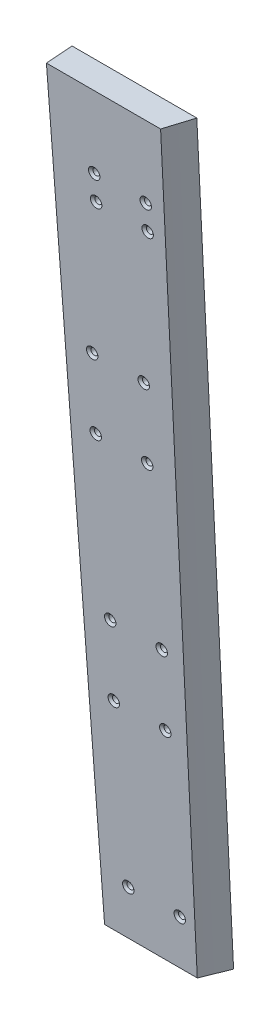
ISO-10303-21;
HEADER;
FILE_DESCRIPTION(('STEP AP214'),'2;1');
FILE_NAME('part.step','',(''),(''),'','','');
FILE_SCHEMA(('AUTOMOTIVE_DESIGN { 1 0 10303 214 1 1 1 1 }'));
ENDSEC;
DATA;
#1=APPLICATION_CONTEXT('core data for automotive mechanical design processes');
#2=APPLICATION_PROTOCOL_DEFINITION('international standard','automotive_design',2000,#1);
#3=PRODUCT_CONTEXT('',#1,'mechanical');
#4=PRODUCT('Part','Part','',(#3));
#5=PRODUCT_RELATED_PRODUCT_CATEGORY('part','',(#4));
#6=PRODUCT_DEFINITION_FORMATION('','',#4);
#7=PRODUCT_DEFINITION_CONTEXT('part definition',#1,'design');
#8=PRODUCT_DEFINITION('design','',#6,#7);
#9=PRODUCT_DEFINITION_SHAPE('','',#8);
#10=(LENGTH_UNIT() NAMED_UNIT(*) SI_UNIT(.MILLI.,.METRE.));
#11=(NAMED_UNIT(*) PLANE_ANGLE_UNIT() SI_UNIT($,.RADIAN.));
#12=(NAMED_UNIT(*) SI_UNIT($,.STERADIAN.) SOLID_ANGLE_UNIT());
#13=UNCERTAINTY_MEASURE_WITH_UNIT(LENGTH_MEASURE(1.E-05),#10,'distance_accuracy_value','');
#14=(GEOMETRIC_REPRESENTATION_CONTEXT(3) GLOBAL_UNCERTAINTY_ASSIGNED_CONTEXT((#13)) GLOBAL_UNIT_ASSIGNED_CONTEXT((#10,
#11,#12)) REPRESENTATION_CONTEXT('',''));
#15=CARTESIAN_POINT('',(0.,0.,0.));
#16=DIRECTION('',(0.,0.,1.));
#17=DIRECTION('',(1.,0.,0.));
#18=AXIS2_PLACEMENT_3D('',#15,#16,#17);
#19=CARTESIAN_POINT('',(312.419999999995,5767.77608949547,3278.73923989058));
#20=DIRECTION('',(0.,-0.0748289111295098,0.997196386906397));
#21=DIRECTION('',(0.,-0.997196386906397,-0.0748289111295096));
#22=AXIS2_PLACEMENT_3D('',#19,#20,#21);
#23=PLANE('',#22);
#24=CARTESIAN_POINT('',(343.482500000001,5710.44401659627,3274.43708171574));
#25=DIRECTION('',(0.,-0.0748289111295097,0.997196386906397));
#26=DIRECTION('',(0.,-0.997196386906397,-0.0748289111295096));
#27=AXIS2_PLACEMENT_3D('',#24,#25,#26);
#28=CIRCLE('',#27,4.21640000000001);
#29=CARTESIAN_POINT('',(343.482500000001,5706.23943775052,3274.12157309486));
#30=VERTEX_POINT('',#29);
#31=EDGE_CURVE('E299',#30,#30,#28,.T.);
#32=ORIENTED_EDGE('',*,*,#31,.F.);
#33=EDGE_LOOP('',(#32));
#34=FACE_BOUND('',#33,.T.);
#35=CARTESIAN_POINT('',(381.5825,5710.44401659627,3274.43708171574));
#36=DIRECTION('',(0.,-0.0748289111295097,0.997196386906397));
#37=DIRECTION('',(0.,-0.997196386906397,-0.0748289111295096));
#38=AXIS2_PLACEMENT_3D('',#35,#36,#37);
#39=CIRCLE('',#38,4.21640000000001);
#40=CARTESIAN_POINT('',(381.5825,5706.23943775052,3274.12157309486));
#41=VERTEX_POINT('',#40);
#42=EDGE_CURVE('E293',#41,#41,#39,.T.);
#43=ORIENTED_EDGE('',*,*,#42,.F.);
#44=EDGE_LOOP('',(#43));
#45=FACE_BOUND('',#44,.T.);
#46=CARTESIAN_POINT('',(381.5825,5691.44742542571,3273.01159095873));
#47=DIRECTION('',(0.,-0.0748289111295097,0.997196386906397));
#48=DIRECTION('',(0.,-0.997196386906397,-0.0748289111295096));
#49=AXIS2_PLACEMENT_3D('',#46,#47,#48);
#50=CIRCLE('',#49,4.21640000000001);
#51=CARTESIAN_POINT('',(381.5825,5687.24284657995,3272.69608233784));
#52=VERTEX_POINT('',#51);
#53=EDGE_CURVE('E286',#52,#52,#50,.T.);
#54=ORIENTED_EDGE('',*,*,#53,.F.);
#55=EDGE_LOOP('',(#54));
#56=FACE_BOUND('',#55,.T.);
#57=CARTESIAN_POINT('',(343.4825,5691.44742542571,3273.01159095873));
#58=DIRECTION('',(0.,-0.0748289111295097,0.997196386906397));
#59=DIRECTION('',(0.,-0.997196386906397,-0.0748289111295096));
#60=AXIS2_PLACEMENT_3D('',#57,#58,#59);
#61=CIRCLE('',#60,4.21640000000001);
#62=CARTESIAN_POINT('',(343.4825,5687.24284657995,3272.69608233784));
#63=VERTEX_POINT('',#62);
#64=EDGE_CURVE('E279',#63,#63,#61,.T.);
#65=ORIENTED_EDGE('',*,*,#64,.F.);
#66=EDGE_LOOP('',(#65));
#67=FACE_BOUND('',#66,.T.);
#68=CARTESIAN_POINT('',(332.58553483878,5585.25466109771,3265.04296107916));
#69=DIRECTION('',(0.,-0.0748289111295097,0.997196386906397));
#70=DIRECTION('',(0.,-0.997196386906397,-0.0748289111295096));
#71=AXIS2_PLACEMENT_3D('',#68,#69,#70);
#72=CIRCLE('',#71,4.21640000000001);
#73=CARTESIAN_POINT('',(332.58553483878,5581.05008225195,3264.72745245827));
#74=VERTEX_POINT('',#73);
#75=EDGE_CURVE('E272',#74,#74,#72,.T.);
#76=ORIENTED_EDGE('',*,*,#75,.F.);
#77=EDGE_LOOP('',(#76));
#78=FACE_BOUND('',#77,.T.);
#79=CARTESIAN_POINT('',(370.699301502672,5585.25466111012,3265.04296108009));
#80=DIRECTION('',(0.,-0.0748289111295097,0.997196386906397));
#81=DIRECTION('',(0.,-0.997196386906397,-0.0748289111295096));
#82=AXIS2_PLACEMENT_3D('',#79,#80,#81);
#83=CIRCLE('',#82,4.21640000000001);
#84=CARTESIAN_POINT('',(370.699301502672,5581.05008226437,3264.7274524592));
#85=VERTEX_POINT('',#84);
#86=EDGE_CURVE('E265',#85,#85,#83,.T.);
#87=ORIENTED_EDGE('',*,*,#86,.F.);
#88=EDGE_LOOP('',(#87));
#89=FACE_BOUND('',#88,.T.);
#90=CARTESIAN_POINT('',(369.230750677282,5530.74435745182,3260.95254647205));
#91=DIRECTION('',(0.,-0.0748289111295097,0.997196386906397));
#92=DIRECTION('',(0.,-0.997196386906397,-0.0748289111295096));
#93=AXIS2_PLACEMENT_3D('',#90,#91,#92);
#94=CIRCLE('',#93,4.21640000000001);
#95=CARTESIAN_POINT('',(369.230750677282,5526.53977860607,3260.63703785116));
#96=VERTEX_POINT('',#95);
#97=EDGE_CURVE('E258',#96,#96,#94,.T.);
#98=ORIENTED_EDGE('',*,*,#97,.F.);
#99=EDGE_LOOP('',(#98));
#100=FACE_BOUND('',#99,.T.);
#101=CARTESIAN_POINT('',(331.116984014263,5530.74435747201,3260.95254647356));
#102=DIRECTION('',(0.,-0.0748289111295097,0.997196386906397));
#103=DIRECTION('',(0.,-0.997196386906397,-0.0748289111295096));
#104=AXIS2_PLACEMENT_3D('',#101,#102,#103);
#105=CIRCLE('',#104,4.21640000000001);
#106=CARTESIAN_POINT('',(331.116984014263,5526.53977862626,3260.63703785268));
#107=VERTEX_POINT('',#106);
#108=EDGE_CURVE('E251',#107,#107,#105,.T.);
#109=ORIENTED_EDGE('',*,*,#108,.F.);
#110=EDGE_LOOP('',(#109));
#111=FACE_BOUND('',#110,.T.);
#112=CARTESIAN_POINT('',(332.585534839496,5407.45466109737,3251.7009749132));
#113=DIRECTION('',(0.,-0.0748289111295097,0.997196386906397));
#114=DIRECTION('',(0.,-0.997196386906397,-0.0748289111295096));
#115=AXIS2_PLACEMENT_3D('',#112,#113,#114);
#116=CIRCLE('',#115,4.21640000000001);
#117=CARTESIAN_POINT('',(332.585534839496,5403.25008225162,3251.38546629231));
#118=VERTEX_POINT('',#117);
#119=EDGE_CURVE('E244',#118,#118,#116,.T.);
#120=ORIENTED_EDGE('',*,*,#119,.F.);
#121=EDGE_LOOP('',(#120));
#122=FACE_BOUND('',#121,.T.);
#123=CARTESIAN_POINT('',(370.699301503388,5407.45466110813,3251.70097491401));
#124=DIRECTION('',(0.,-0.0748289111295097,0.997196386906397));
#125=DIRECTION('',(0.,-0.997196386906397,-0.0748289111295096));
#126=AXIS2_PLACEMENT_3D('',#123,#124,#125);
#127=CIRCLE('',#126,4.21640000000001);
#128=CARTESIAN_POINT('',(370.699301503388,5403.25008226238,3251.38546629312));
#129=VERTEX_POINT('',#128);
#130=EDGE_CURVE('E237',#129,#129,#127,.T.);
#131=ORIENTED_EDGE('',*,*,#130,.F.);
#132=EDGE_LOOP('',(#131));
#133=FACE_BOUND('',#132,.T.);
#134=CARTESIAN_POINT('',(369.230853476843,5352.94435745354,3247.61056030624));
#135=DIRECTION('',(0.,-0.0748289111295097,0.997196386906397));
#136=DIRECTION('',(0.,-0.997196386906397,-0.0748289111295096));
#137=AXIS2_PLACEMENT_3D('',#134,#135,#136);
#138=CIRCLE('',#137,4.21640000000001);
#139=CARTESIAN_POINT('',(369.230853476843,5348.73977860778,3247.29505168535));
#140=VERTEX_POINT('',#139);
#141=EDGE_CURVE('E230',#140,#140,#138,.T.);
#142=ORIENTED_EDGE('',*,*,#141,.F.);
#143=EDGE_LOOP('',(#142));
#144=FACE_BOUND('',#143,.T.);
#145=CARTESIAN_POINT('',(331.117086813825,5352.94435747207,3247.61056030763));
#146=DIRECTION('',(0.,-0.0748289111295097,0.997196386906397));
#147=DIRECTION('',(0.,-0.997196386906397,-0.0748289111295096));
#148=AXIS2_PLACEMENT_3D('',#145,#146,#147);
#149=CIRCLE('',#148,4.21640000000001);
#150=CARTESIAN_POINT('',(331.117086813825,5348.73977862632,3247.29505168674));
#151=VERTEX_POINT('',#150);
#152=EDGE_CURVE('E223',#151,#151,#149,.T.);
#153=ORIENTED_EDGE('',*,*,#152,.F.);
#154=EDGE_LOOP('',(#153));
#155=FACE_BOUND('',#154,.T.);
#156=CARTESIAN_POINT('',(370.699301503413,5229.65466110813,3238.35898874807));
#157=DIRECTION('',(0.,-0.0748289111295097,0.997196386906397));
#158=DIRECTION('',(0.,-0.997196386906397,-0.0748289111295096));
#159=AXIS2_PLACEMENT_3D('',#156,#157,#158);
#160=CIRCLE('',#159,4.21640000000001);
#161=CARTESIAN_POINT('',(370.699301503413,5225.45008226237,3238.04348012718));
#162=VERTEX_POINT('',#161);
#163=EDGE_CURVE('E216',#162,#162,#160,.T.);
#164=ORIENTED_EDGE('',*,*,#163,.F.);
#165=EDGE_LOOP('',(#164));
#166=FACE_BOUND('',#165,.T.);
#167=CARTESIAN_POINT('',(332.585534839522,5229.65466109737,3238.35898874726));
#168=DIRECTION('',(0.,-0.0748289111295097,0.997196386906397));
#169=DIRECTION('',(0.,-0.997196386906397,-0.0748289111295096));
#170=AXIS2_PLACEMENT_3D('',#167,#168,#169);
#171=CIRCLE('',#170,4.21640000000001);
#172=CARTESIAN_POINT('',(332.585534839522,5225.45008225162,3238.04348012638));
#173=VERTEX_POINT('',#172);
#174=EDGE_CURVE('E205',#173,#173,#171,.T.);
#175=ORIENTED_EDGE('',*,*,#174,.F.);
#176=EDGE_LOOP('',(#175));
#177=FACE_BOUND('',#176,.T.);
#178=DIRECTION('',(0.,-0.997196386906396,-0.0748289111295135));
#179=VECTOR('',#178,1.);
#180=CARTESIAN_POINT('',(312.419999999995,5767.77608949547,3278.73923989058));
#181=LINE('',#180,#179);
#182=CARTESIAN_POINT('',(312.419999999995,5767.77608949546,3278.73923989058));
#183=VERTEX_POINT('',#182);
#184=CARTESIAN_POINT('',(312.419999999996,5194.3,3235.706));
#185=VERTEX_POINT('',#184);
#186=EDGE_CURVE('E166',#183,#185,#181,.T.);
#187=ORIENTED_EDGE('',*,*,#186,.T.);
#188=DIRECTION('',(1.,0.,0.));
#189=VECTOR('',#188,1.);
#190=CARTESIAN_POINT('',(312.419999999996,5194.3,3235.706));
#191=LINE('',#190,#189);
#192=CARTESIAN_POINT('',(380.999999999788,5194.3,3235.70600000048));
#193=VERTEX_POINT('',#192);
#194=EDGE_CURVE('E102',#193,#185,#191,.F.);
#195=ORIENTED_EDGE('',*,*,#194,.F.);
#196=DIRECTION('',(-0.0276324655190278,-0.996815607984742,-0.0748003377489091));
#197=VECTOR('',#196,1.);
#198=CARTESIAN_POINT('',(388.968512318236,5481.75670364397,3257.27654760127));
#199=LINE('',#198,#197);
#200=CARTESIAN_POINT('',(396.897181125412,5767.77608949542,3278.73923989111));
#201=VERTEX_POINT('',#200);
#202=EDGE_CURVE('E98',#201,#193,#199,.T.);
#203=ORIENTED_EDGE('',*,*,#202,.F.);
#204=DIRECTION('',(1.,0.,0.));
#205=VECTOR('',#204,1.);
#206=CARTESIAN_POINT('',(312.419999999995,5767.77608949546,3278.73923989058));
#207=LINE('',#206,#205);
#208=EDGE_CURVE('E113',#183,#201,#207,.T.);
#209=ORIENTED_EDGE('',*,*,#208,.F.);
#210=EDGE_LOOP('',(#187,#195,#203,#209));
#211=FACE_BOUND('',#210,.T.);
#212=ADVANCED_FACE('F50',(#34,#45,#56,#67,#78,#89,#100,#111,#122,#133,#144,#155,#166,#177,#211),
#23,.T.);
#213=CARTESIAN_POINT('',(405.196853838781,5769.20076169359,3258.48146242823));
#214=CARTESIAN_POINT('',(399.713953138321,5577.55929881066,3244.52122134532));
#215=CARTESIAN_POINT('',(394.231054672582,5385.91783579814,3230.56097424694));
#216=CARTESIAN_POINT('',(388.74815891467,5194.27637261328,3216.60071985852));
#217=CARTESIAN_POINT('',(402.536032037975,5769.20517503958,3265.26188551318));
#218=CARTESIAN_POINT('',(397.108078605894,5577.56498966864,3251.16176934718));
#219=CARTESIAN_POINT('',(391.680127390671,5385.92480418547,3237.06164916942));
#220=CARTESIAN_POINT('',(386.252177322128,5194.28461860905,3222.96152394867));
#221=CARTESIAN_POINT('',(399.782874856838,5769.20939052787,3272.05044170521));
#222=CARTESIAN_POINT('',(394.41177201546,5577.57042539221,3257.81028396343));
#223=CARTESIAN_POINT('',(389.040670658161,5385.93146018714,3243.5701242145));
#224=CARTESIAN_POINT('',(383.669569532895,5194.29249494666,3229.32996185289));
#225=CARTESIAN_POINT('',(396.937024636896,5769.21340728806,3278.84709520156));
#226=CARTESIAN_POINT('',(391.624683091122,5577.57560485867,3264.46673013469));
#227=CARTESIAN_POINT('',(386.312341545349,5385.93780242927,3250.08636506784));
#228=CARTESIAN_POINT('',(380.999999999577,5194.2999999999,3235.70600000099));
#229=B_SPLINE_SURFACE_WITH_KNOTS('',3,3,((#213,#214,#215,#216),(#217,#218,#219,#220),(#221,#222,
#223,#224),(#225,#226,#227,#228)),.UNSPECIFIED.,.F.,.F.,.F.,(4,4),(4,4),(-0.0263043909921353,
1.3801359465942E-12),(66.3393463865698,123.945907551582),.UNSPECIFIED.);
#230=CARTESIAN_POINT('',(396.897181125634,5767.77608949546,3278.73923989058));
#231=CARTESIAN_POINT('',(400.91830917951,5768.48911461939,3269.23721631951));
#232=CARTESIAN_POINT('',(404.700902723824,5769.20158025248,3259.74264872));
#233=B_SPLINE_CURVE_WITH_KNOTS('',2,(#230,#231,#232),.UNSPECIFIED.,.F.,.F.,(3,3),(0.,1.),.UNSPECIFIED.);
#234=CARTESIAN_POINT('',(404.700902445732,5769.20158025437,3259.74264872015));
#235=VERTEX_POINT('',#234);
#236=EDGE_CURVE('E144',#201,#235,#233,.T.);
#237=CARTESIAN_POINT('',(388.748834672877,5194.3,3216.60244158623));
#238=CARTESIAN_POINT('',(388.075829832683,5194.30000000001,3218.31721533994));
#239=CARTESIAN_POINT('',(387.397559503474,5194.30000000001,3220.02991977192));
#240=CARTESIAN_POINT('',(386.030596461004,5194.30000000001,3223.45116430792));
#241=CARTESIAN_POINT('',(385.341903748529,5194.30000000001,3225.15970441226));
#242=CARTESIAN_POINT('',(383.447384508373,5194.3,3229.81906148917));
#243=CARTESIAN_POINT('',(382.231272738763,5194.3,3232.76570034628));
#244=CARTESIAN_POINT('',(380.999999999791,5194.30000000001,3235.70600000049));
#245=B_SPLINE_CURVE_WITH_KNOTS('',3,(#237,#238,#239,#240,#241,#242,#243,#244),.UNSPECIFIED.,.F.,
.F.,(4,2,2,4),(0.,5.5263289650897,11.0526575132116,20.6156723645517),.UNSPECIFIED.);
#246=CARTESIAN_POINT('',(388.748833941195,5194.30000000001,3216.60244129906));
#247=VERTEX_POINT('',#246);
#248=EDGE_CURVE('E92',#247,#193,#245,.T.);
#249=CARTESIAN_POINT('',(404.700902167638,5769.20158025625,3259.7426487203));
#250=CARTESIAN_POINT('',(404.293319696534,5754.51171006712,3258.64033125774));
#251=CARTESIAN_POINT('',(403.885735478663,5739.82183992617,3257.5380137988));
#252=CARTESIAN_POINT('',(401.847805523786,5666.37248946604,3252.02642652244));
#253=CARTESIAN_POINT('',(400.217433190222,5607.61300988068,3247.61715676009));
#254=CARTESIAN_POINT('',(396.947394798616,5489.76127418242,3238.77364592029));
#255=CARTESIAN_POINT('',(395.307728399182,5430.66901807896,3234.33940484353));
#256=CARTESIAN_POINT('',(392.028331025051,5312.48450765377,3225.47092282373));
#257=CARTESIAN_POINT('',(390.388600050355,5253.39225333205,3221.03668188068));
#258=CARTESIAN_POINT('',(388.748834896997,5194.29999995344,3216.6024410084));
#259=B_SPLINE_CURVE_WITH_KNOTS('',3,(#249,#250,#251,#252,#253,#254,#255,#256,#257,#258),
.UNSPECIFIED.,.F.,.F.,(4,2,2,2,4),(0.,44.210424346468,221.052121732371,398.89534364712,
576.738565562073),.UNSPECIFIED.);
#260=EDGE_CURVE('E96',#235,#247,#259,.T.);
#261=ORIENTED_EDGE('',*,*,#236,.F.);
#262=ORIENTED_EDGE('',*,*,#202,.T.);
#263=ORIENTED_EDGE('',*,*,#248,.F.);
#264=ORIENTED_EDGE('',*,*,#260,.F.);
#265=EDGE_LOOP('',(#261,#262,#263,#264));
#266=FACE_BOUND('',#265,.T.);
#267=ADVANCED_FACE('F52',(#266),#229,.T.);
#268=CARTESIAN_POINT('',(312.419999999996,5194.3,3235.706));
#269=DIRECTION('',(0.,-1.,0.));
#270=DIRECTION('',(0.,0.,-1.));
#271=AXIS2_PLACEMENT_3D('',#268,#269,#270);
#272=PLANE('',#271);
#273=DIRECTION('',(0.,0.,-1.));
#274=VECTOR('',#273,1.);
#275=CARTESIAN_POINT('',(312.419999999996,5194.3,3247.67084045122));
#276=LINE('',#275,#274);
#277=CARTESIAN_POINT('',(312.419999999996,5194.3,3216.60244101189));
#278=VERTEX_POINT('',#277);
#279=EDGE_CURVE('E108',#185,#278,#276,.T.);
#280=ORIENTED_EDGE('',*,*,#279,.T.);
#281=DIRECTION('',(1.,0.,0.));
#282=VECTOR('',#281,1.);
#283=CARTESIAN_POINT('',(312.419999999996,5194.3,3216.60244101189));
#284=LINE('',#283,#282);
#285=EDGE_CURVE('E105',#247,#278,#284,.F.);
#286=ORIENTED_EDGE('',*,*,#285,.F.);
#287=ORIENTED_EDGE('',*,*,#248,.T.);
#288=ORIENTED_EDGE('',*,*,#194,.T.);
#289=EDGE_LOOP('',(#280,#286,#287,#288));
#290=FACE_BOUND('',#289,.T.);
#291=ADVANCED_FACE('F106',(#290),#272,.T.);
#292=CARTESIAN_POINT('',(312.419999999995,5481.75079012623,3247.67084045122));
#293=DIRECTION('',(1.,0.,0.));
#294=DIRECTION('',(0.,0.,-1.));
#295=AXIS2_PLACEMENT_3D('',#292,#293,#294);
#296=PLANE('',#295);
#297=ORIENTED_EDGE('',*,*,#279,.F.);
#298=ORIENTED_EDGE('',*,*,#186,.F.);
#299=DIRECTION('',(0.,-0.0748289111295177,0.997196386906396));
#300=VECTOR('',#299,1.);
#301=CARTESIAN_POINT('',(312.419999999994,5769.20158025248,3259.74264872));
#302=LINE('',#301,#300);
#303=CARTESIAN_POINT('',(312.419999999995,5769.20158025248,3259.74264872001));
#304=VERTEX_POINT('',#303);
#305=EDGE_CURVE('E72',#304,#183,#302,.T.);
#306=ORIENTED_EDGE('',*,*,#305,.F.);
#307=DIRECTION('',(0.,0.997196386906397,0.0748289111295111));
#308=VECTOR('',#307,1.);
#309=CARTESIAN_POINT('',(312.419999999996,5194.3,3216.60244101189));
#310=LINE('',#309,#308);
#311=EDGE_CURVE('E63',#278,#304,#310,.T.);
#312=ORIENTED_EDGE('',*,*,#311,.F.);
#313=EDGE_LOOP('',(#297,#298,#306,#312));
#314=FACE_BOUND('',#313,.T.);
#315=ADVANCED_FACE('F141',(#314),#296,.F.);
#316=CARTESIAN_POINT('',(312.419999999994,5769.20158025248,3259.74264872));
#317=DIRECTION('',(0.,0.997196386906397,0.0748289111295177));
#318=DIRECTION('',(0.,-0.0748289111295177,0.997196386906396));
#319=AXIS2_PLACEMENT_3D('',#316,#317,#318);
#320=PLANE('',#319);
#321=ORIENTED_EDGE('',*,*,#305,.T.);
#322=ORIENTED_EDGE('',*,*,#208,.T.);
#323=ORIENTED_EDGE('',*,*,#236,.T.);
#324=DIRECTION('',(1.,0.,0.));
#325=VECTOR('',#324,1.);
#326=CARTESIAN_POINT('',(312.419999999995,5769.20158025248,3259.74264872001));
#327=LINE('',#326,#325);
#328=EDGE_CURVE('E13',#304,#235,#327,.T.);
#329=ORIENTED_EDGE('',*,*,#328,.F.);
#330=EDGE_LOOP('',(#321,#322,#323,#329));
#331=FACE_BOUND('',#330,.T.);
#332=ADVANCED_FACE('F135',(#331),#320,.T.);
#333=CARTESIAN_POINT('',(312.419999999996,5194.3,3216.60244101189));
#334=DIRECTION('',(0.,0.0748289111295113,-0.997196386906397));
#335=DIRECTION('',(0.,0.997196386906397,0.0748289111295111));
#336=AXIS2_PLACEMENT_3D('',#333,#334,#335);
#337=PLANE('',#336);
#338=CARTESIAN_POINT('',(343.4825,5711.86950735329,3255.44049054518));
#339=DIRECTION('',(0.,0.0748289111295113,-0.997196386906397));
#340=DIRECTION('',(0.,0.997196386906397,0.0748289111295111));
#341=AXIS2_PLACEMENT_3D('',#338,#339,#340);
#342=CIRCLE('',#341,2.45744999999997);
#343=CARTESIAN_POINT('',(343.4825,5714.32006761429,3255.62437885284));
#344=VERTEX_POINT('',#343);
#345=EDGE_CURVE('E57',#344,#344,#342,.T.);
#346=ORIENTED_EDGE('',*,*,#345,.F.);
#347=EDGE_LOOP('',(#346));
#348=FACE_BOUND('',#347,.T.);
#349=CARTESIAN_POINT('',(381.5825,5711.86950735329,3255.44049054518));
#350=DIRECTION('',(0.,0.0748289111295113,-0.997196386906397));
#351=DIRECTION('',(0.,0.997196386906397,0.0748289111295111));
#352=AXIS2_PLACEMENT_3D('',#349,#350,#351);
#353=CIRCLE('',#352,2.45744999999997);
#354=CARTESIAN_POINT('',(381.5825,5714.32006761429,3255.62437885284));
#355=VERTEX_POINT('',#354);
#356=EDGE_CURVE('E289',#355,#355,#353,.T.);
#357=ORIENTED_EDGE('',*,*,#356,.F.);
#358=EDGE_LOOP('',(#357));
#359=FACE_BOUND('',#358,.T.);
#360=CARTESIAN_POINT('',(381.582500000001,5692.87291618272,3254.01499978816));
#361=DIRECTION('',(0.,0.0748289111295113,-0.997196386906397));
#362=DIRECTION('',(0.,0.997196386906397,0.0748289111295111));
#363=AXIS2_PLACEMENT_3D('',#360,#361,#362);
#364=CIRCLE('',#363,2.45744999999997);
#365=CARTESIAN_POINT('',(381.582500000001,5695.32347644373,3254.19888809582));
#366=VERTEX_POINT('',#365);
#367=EDGE_CURVE('E282',#366,#366,#364,.T.);
#368=ORIENTED_EDGE('',*,*,#367,.F.);
#369=EDGE_LOOP('',(#368));
#370=FACE_BOUND('',#369,.T.);
#371=CARTESIAN_POINT('',(343.4825,5692.87291618272,3254.01499978816));
#372=DIRECTION('',(0.,0.0748289111295113,-0.997196386906397));
#373=DIRECTION('',(0.,0.997196386906397,0.0748289111295111));
#374=AXIS2_PLACEMENT_3D('',#371,#372,#373);
#375=CIRCLE('',#374,2.45744999999997);
#376=CARTESIAN_POINT('',(343.4825,5695.32347644373,3254.19888809582));
#377=VERTEX_POINT('',#376);
#378=EDGE_CURVE('E275',#377,#377,#375,.T.);
#379=ORIENTED_EDGE('',*,*,#378,.F.);
#380=EDGE_LOOP('',(#379));
#381=FACE_BOUND('',#380,.T.);
#382=CARTESIAN_POINT('',(332.585534838781,5586.68015185472,3246.0463699086));
#383=DIRECTION('',(0.,0.0748289111295113,-0.997196386906397));
#384=DIRECTION('',(0.,0.997196386906397,0.0748289111295111));
#385=AXIS2_PLACEMENT_3D('',#382,#383,#384);
#386=CIRCLE('',#385,2.45744999999997);
#387=CARTESIAN_POINT('',(332.585534838781,5589.13071211573,3246.23025821625));
#388=VERTEX_POINT('',#387);
#389=EDGE_CURVE('E268',#388,#388,#386,.T.);
#390=ORIENTED_EDGE('',*,*,#389,.F.);
#391=EDGE_LOOP('',(#390));
#392=FACE_BOUND('',#391,.T.);
#393=CARTESIAN_POINT('',(370.699301502672,5586.68015186714,3246.04636990953));
#394=DIRECTION('',(0.,0.0748289111295113,-0.997196386906397));
#395=DIRECTION('',(0.,0.997196386906397,0.0748289111295111));
#396=AXIS2_PLACEMENT_3D('',#393,#394,#395);
#397=CIRCLE('',#396,2.45744999999997);
#398=CARTESIAN_POINT('',(370.699301502672,5589.13071212814,3246.23025821719));
#399=VERTEX_POINT('',#398);
#400=EDGE_CURVE('E261',#399,#399,#397,.T.);
#401=ORIENTED_EDGE('',*,*,#400,.F.);
#402=EDGE_LOOP('',(#401));
#403=FACE_BOUND('',#402,.T.);
#404=CARTESIAN_POINT('',(369.230750677281,5532.16984820883,3241.95595530149));
#405=DIRECTION('',(0.,0.0748289111295113,-0.997196386906397));
#406=DIRECTION('',(0.,0.997196386906397,0.0748289111295111));
#407=AXIS2_PLACEMENT_3D('',#404,#405,#406);
#408=CIRCLE('',#407,2.45744999999997);
#409=CARTESIAN_POINT('',(369.230750677281,5534.62040846984,3242.13984360914));
#410=VERTEX_POINT('',#409);
#411=EDGE_CURVE('E254',#410,#410,#408,.T.);
#412=ORIENTED_EDGE('',*,*,#411,.F.);
#413=EDGE_LOOP('',(#412));
#414=FACE_BOUND('',#413,.T.);
#415=CARTESIAN_POINT('',(331.116984014264,5532.16984822903,3241.955955303));
#416=DIRECTION('',(0.,0.0748289111295113,-0.997196386906397));
#417=DIRECTION('',(0.,0.997196386906397,0.0748289111295111));
#418=AXIS2_PLACEMENT_3D('',#415,#416,#417);
#419=CIRCLE('',#418,2.45744999999997);
#420=CARTESIAN_POINT('',(331.116984014264,5534.62040849003,3242.13984361066));
#421=VERTEX_POINT('',#420);
#422=EDGE_CURVE('E247',#421,#421,#419,.T.);
#423=ORIENTED_EDGE('',*,*,#422,.F.);
#424=EDGE_LOOP('',(#423));
#425=FACE_BOUND('',#424,.T.);
#426=CARTESIAN_POINT('',(332.585534839497,5408.88015185439,3232.70438374264));
#427=DIRECTION('',(0.,0.0748289111295113,-0.997196386906397));
#428=DIRECTION('',(0.,0.997196386906397,0.0748289111295111));
#429=AXIS2_PLACEMENT_3D('',#426,#427,#428);
#430=CIRCLE('',#429,2.45744999999997);
#431=CARTESIAN_POINT('',(332.585534839497,5411.33071211539,3232.88827205029));
#432=VERTEX_POINT('',#431);
#433=EDGE_CURVE('E240',#432,#432,#430,.T.);
#434=ORIENTED_EDGE('',*,*,#433,.F.);
#435=EDGE_LOOP('',(#434));
#436=FACE_BOUND('',#435,.T.);
#437=CARTESIAN_POINT('',(370.699301503388,5408.88015186514,3232.70438374344));
#438=DIRECTION('',(0.,0.0748289111295113,-0.997196386906397));
#439=DIRECTION('',(0.,0.997196386906397,0.0748289111295111));
#440=AXIS2_PLACEMENT_3D('',#437,#438,#439);
#441=CIRCLE('',#440,2.45744999999997);
#442=CARTESIAN_POINT('',(370.699301503388,5411.33071212615,3232.8882720511));
#443=VERTEX_POINT('',#442);
#444=EDGE_CURVE('E233',#443,#443,#441,.T.);
#445=ORIENTED_EDGE('',*,*,#444,.F.);
#446=EDGE_LOOP('',(#445));
#447=FACE_BOUND('',#446,.T.);
#448=CARTESIAN_POINT('',(369.230853476842,5354.36984821055,3228.61396913568));
#449=DIRECTION('',(0.,0.0748289111295113,-0.997196386906397));
#450=DIRECTION('',(0.,0.997196386906397,0.0748289111295111));
#451=AXIS2_PLACEMENT_3D('',#448,#449,#450);
#452=CIRCLE('',#451,2.45744999999997);
#453=CARTESIAN_POINT('',(369.230853476842,5356.82040847156,3228.79785744333));
#454=VERTEX_POINT('',#453);
#455=EDGE_CURVE('E226',#454,#454,#452,.T.);
#456=ORIENTED_EDGE('',*,*,#455,.F.);
#457=EDGE_LOOP('',(#456));
#458=FACE_BOUND('',#457,.T.);
#459=CARTESIAN_POINT('',(331.117086813826,5354.36984822909,3228.61396913707));
#460=DIRECTION('',(0.,0.0748289111295113,-0.997196386906397));
#461=DIRECTION('',(0.,0.997196386906397,0.0748289111295111));
#462=AXIS2_PLACEMENT_3D('',#459,#460,#461);
#463=CIRCLE('',#462,2.45744999999997);
#464=CARTESIAN_POINT('',(331.117086813826,5356.82040849009,3228.79785744472));
#465=VERTEX_POINT('',#464);
#466=EDGE_CURVE('E219',#465,#465,#463,.T.);
#467=ORIENTED_EDGE('',*,*,#466,.F.);
#468=EDGE_LOOP('',(#467));
#469=FACE_BOUND('',#468,.T.);
#470=CARTESIAN_POINT('',(370.699301503413,5231.08015186514,3219.36239757751));
#471=DIRECTION('',(0.,0.0748289111295113,-0.997196386906397));
#472=DIRECTION('',(0.,0.997196386906397,0.0748289111295111));
#473=AXIS2_PLACEMENT_3D('',#470,#471,#472);
#474=CIRCLE('',#473,2.45744999999997);
#475=CARTESIAN_POINT('',(370.699301503413,5233.53071212615,3219.54628588516));
#476=VERTEX_POINT('',#475);
#477=EDGE_CURVE('E207',#476,#476,#474,.T.);
#478=ORIENTED_EDGE('',*,*,#477,.F.);
#479=EDGE_LOOP('',(#478));
#480=FACE_BOUND('',#479,.T.);
#481=CARTESIAN_POINT('',(332.585534839521,5231.08015185439,3219.3623975767));
#482=DIRECTION('',(0.,0.0748289111295113,-0.997196386906397));
#483=DIRECTION('',(0.,0.997196386906397,0.0748289111295111));
#484=AXIS2_PLACEMENT_3D('',#481,#482,#483);
#485=CIRCLE('',#484,2.45744999999997);
#486=CARTESIAN_POINT('',(332.585534839521,5233.53071211539,3219.54628588435));
#487=VERTEX_POINT('',#486);
#488=EDGE_CURVE('E202',#487,#487,#485,.T.);
#489=ORIENTED_EDGE('',*,*,#488,.F.);
#490=EDGE_LOOP('',(#489));
#491=FACE_BOUND('',#490,.T.);
#492=ORIENTED_EDGE('',*,*,#311,.T.);
#493=ORIENTED_EDGE('',*,*,#328,.T.);
#494=ORIENTED_EDGE('',*,*,#260,.T.);
#495=ORIENTED_EDGE('',*,*,#285,.T.);
#496=EDGE_LOOP('',(#492,#493,#494,#495));
#497=FACE_BOUND('',#496,.T.);
#498=ADVANCED_FACE('F112',(#348,#359,#370,#381,#392,#403,#414,#425,#436,#447,#458,#469,#480,
#491,#497),#337,.T.);
#499=CARTESIAN_POINT('',(332.585534839522,5229.65466109737,3238.35898874726));
#500=DIRECTION('',(0.,-0.0748289111295097,0.997196386906397));
#501=DIRECTION('',(0.,-0.997196386906397,-0.0748289111295096));
#502=AXIS2_PLACEMENT_3D('',#499,#500,#501);
#503=CYLINDRICAL_SURFACE('',#502,2.45744999999997);
#504=ORIENTED_EDGE('',*,*,#488,.T.);
#505=EDGE_LOOP('',(#504));
#506=FACE_BOUND('',#505,.T.);
#507=CARTESIAN_POINT('',(332.585534839523,5229.76510365366,3236.88719239972));
#508=DIRECTION('',(0.,-0.0748289111295097,0.997196386906397));
#509=DIRECTION('',(0.,-0.997196386906397,-0.0748289111295096));
#510=AXIS2_PLACEMENT_3D('',#507,#508,#509);
#511=CIRCLE('',#510,2.45744999999997);
#512=CARTESIAN_POINT('',(332.585534839523,5227.31454339266,3236.70330409207));
#513=VERTEX_POINT('',#512);
#514=EDGE_CURVE('E147',#513,#513,#511,.T.);
#515=ORIENTED_EDGE('',*,*,#514,.T.);
#516=EDGE_LOOP('',(#515));
#517=FACE_BOUND('',#516,.T.);
#518=ADVANCED_FACE('F134',(#506,#517),#503,.F.);
#519=CARTESIAN_POINT('',(332.585534839522,5229.65466109737,3238.35898874726));
#520=DIRECTION('',(0.,-0.0748289111295097,0.997196386906397));
#521=DIRECTION('',(0.,-0.997196386906397,-0.0748289111295096));
#522=AXIS2_PLACEMENT_3D('',#519,#520,#521);
#523=CONICAL_SURFACE('',#522,4.21640000000001,0.872664625997234);
#524=ORIENTED_EDGE('',*,*,#514,.F.);
#525=EDGE_LOOP('',(#524));
#526=FACE_BOUND('',#525,.T.);
#527=ORIENTED_EDGE('',*,*,#174,.T.);
#528=EDGE_LOOP('',(#527));
#529=FACE_BOUND('',#528,.T.);
#530=ADVANCED_FACE('F192',(#526,#529),#523,.F.);
#531=CARTESIAN_POINT('',(370.699301503413,5229.65466110813,3238.35898874807));
#532=DIRECTION('',(0.,-0.0748289111295097,0.997196386906397));
#533=DIRECTION('',(0.,-0.997196386906397,-0.0748289111295096));
#534=AXIS2_PLACEMENT_3D('',#531,#532,#533);
#535=CYLINDRICAL_SURFACE('',#534,2.45744999999997);
#536=ORIENTED_EDGE('',*,*,#477,.T.);
#537=EDGE_LOOP('',(#536));
#538=FACE_BOUND('',#537,.T.);
#539=CARTESIAN_POINT('',(370.699301503413,5229.76510366441,3236.88719240053));
#540=DIRECTION('',(0.,-0.0748289111295097,0.997196386906397));
#541=DIRECTION('',(0.,-0.997196386906397,-0.0748289111295096));
#542=AXIS2_PLACEMENT_3D('',#539,#540,#541);
#543=CIRCLE('',#542,2.45744999999997);
#544=CARTESIAN_POINT('',(370.699301503413,5227.31454340341,3236.70330409287));
#545=VERTEX_POINT('',#544);
#546=EDGE_CURVE('E211',#545,#545,#543,.T.);
#547=ORIENTED_EDGE('',*,*,#546,.T.);
#548=EDGE_LOOP('',(#547));
#549=FACE_BOUND('',#548,.T.);
#550=ADVANCED_FACE('F197',(#538,#549),#535,.F.);
#551=CARTESIAN_POINT('',(370.699301503413,5229.65466110813,3238.35898874807));
#552=DIRECTION('',(0.,-0.0748289111295097,0.997196386906397));
#553=DIRECTION('',(0.,-0.997196386906397,-0.0748289111295096));
#554=AXIS2_PLACEMENT_3D('',#551,#552,#553);
#555=CONICAL_SURFACE('',#554,4.21640000000001,0.872664625997234);
#556=ORIENTED_EDGE('',*,*,#546,.F.);
#557=EDGE_LOOP('',(#556));
#558=FACE_BOUND('',#557,.T.);
#559=ORIENTED_EDGE('',*,*,#163,.T.);
#560=EDGE_LOOP('',(#559));
#561=FACE_BOUND('',#560,.T.);
#562=ADVANCED_FACE('F401',(#558,#561),#555,.F.);
#563=CARTESIAN_POINT('',(331.117086813825,5352.94435747207,3247.61056030763));
#564=DIRECTION('',(0.,-0.0748289111295097,0.997196386906397));
#565=DIRECTION('',(0.,-0.997196386906397,-0.0748289111295096));
#566=AXIS2_PLACEMENT_3D('',#563,#564,#565);
#567=CYLINDRICAL_SURFACE('',#566,2.45744999999997);
#568=ORIENTED_EDGE('',*,*,#466,.T.);
#569=EDGE_LOOP('',(#568));
#570=FACE_BOUND('',#569,.T.);
#571=CARTESIAN_POINT('',(331.117086813826,5353.05480002836,3246.13876396009));
#572=DIRECTION('',(0.,-0.0748289111295097,0.997196386906397));
#573=DIRECTION('',(0.,-0.997196386906397,-0.0748289111295096));
#574=AXIS2_PLACEMENT_3D('',#571,#572,#573);
#575=CIRCLE('',#574,2.45744999999997);
#576=CARTESIAN_POINT('',(331.117086813826,5350.60423976735,3245.95487565244));
#577=VERTEX_POINT('',#576);
#578=EDGE_CURVE('E220',#577,#577,#575,.T.);
#579=ORIENTED_EDGE('',*,*,#578,.T.);
#580=EDGE_LOOP('',(#579));
#581=FACE_BOUND('',#580,.T.);
#582=ADVANCED_FACE('F397',(#570,#581),#567,.F.);
#583=CARTESIAN_POINT('',(331.117086813825,5352.94435747207,3247.61056030763));
#584=DIRECTION('',(0.,-0.0748289111295097,0.997196386906397));
#585=DIRECTION('',(0.,-0.997196386906397,-0.0748289111295096));
#586=AXIS2_PLACEMENT_3D('',#583,#584,#585);
#587=CONICAL_SURFACE('',#586,4.21640000000001,0.872664625997234);
#588=ORIENTED_EDGE('',*,*,#578,.F.);
#589=EDGE_LOOP('',(#588));
#590=FACE_BOUND('',#589,.T.);
#591=ORIENTED_EDGE('',*,*,#152,.T.);
#592=EDGE_LOOP('',(#591));
#593=FACE_BOUND('',#592,.T.);
#594=ADVANCED_FACE('F393',(#590,#593),#587,.F.);
#595=CARTESIAN_POINT('',(369.230853476843,5352.94435745354,3247.61056030624));
#596=DIRECTION('',(0.,-0.0748289111295097,0.997196386906397));
#597=DIRECTION('',(0.,-0.997196386906397,-0.0748289111295096));
#598=AXIS2_PLACEMENT_3D('',#595,#596,#597);
#599=CYLINDRICAL_SURFACE('',#598,2.45744999999997);
#600=ORIENTED_EDGE('',*,*,#455,.T.);
#601=EDGE_LOOP('',(#600));
#602=FACE_BOUND('',#601,.T.);
#603=CARTESIAN_POINT('',(369.230853476842,5353.05480000983,3246.1387639587));
#604=DIRECTION('',(0.,-0.0748289111295097,0.997196386906397));
#605=DIRECTION('',(0.,-0.997196386906397,-0.0748289111295096));
#606=AXIS2_PLACEMENT_3D('',#603,#604,#605);
#607=CIRCLE('',#606,2.45744999999997);
#608=CARTESIAN_POINT('',(369.230853476842,5350.60423974882,3245.95487565105));
#609=VERTEX_POINT('',#608);
#610=EDGE_CURVE('E227',#609,#609,#607,.T.);
#611=ORIENTED_EDGE('',*,*,#610,.T.);
#612=EDGE_LOOP('',(#611));
#613=FACE_BOUND('',#612,.T.);
#614=ADVANCED_FACE('F389',(#602,#613),#599,.F.);
#615=CARTESIAN_POINT('',(369.230853476843,5352.94435745354,3247.61056030624));
#616=DIRECTION('',(0.,-0.0748289111295097,0.997196386906397));
#617=DIRECTION('',(0.,-0.997196386906397,-0.0748289111295096));
#618=AXIS2_PLACEMENT_3D('',#615,#616,#617);
#619=CONICAL_SURFACE('',#618,4.21640000000001,0.872664625997234);
#620=ORIENTED_EDGE('',*,*,#610,.F.);
#621=EDGE_LOOP('',(#620));
#622=FACE_BOUND('',#621,.T.);
#623=ORIENTED_EDGE('',*,*,#141,.T.);
#624=EDGE_LOOP('',(#623));
#625=FACE_BOUND('',#624,.T.);
#626=ADVANCED_FACE('F385',(#622,#625),#619,.F.);
#627=CARTESIAN_POINT('',(370.699301503388,5407.45466110813,3251.70097491401));
#628=DIRECTION('',(0.,-0.0748289111295097,0.997196386906397));
#629=DIRECTION('',(0.,-0.997196386906397,-0.0748289111295096));
#630=AXIS2_PLACEMENT_3D('',#627,#628,#629);
#631=CYLINDRICAL_SURFACE('',#630,2.45744999999997);
#632=ORIENTED_EDGE('',*,*,#444,.T.);
#633=EDGE_LOOP('',(#632));
#634=FACE_BOUND('',#633,.T.);
#635=CARTESIAN_POINT('',(370.699301503386,5407.56510366442,3250.22917856646));
#636=DIRECTION('',(0.,-0.0748289111295097,0.997196386906397));
#637=DIRECTION('',(0.,-0.997196386906397,-0.0748289111295096));
#638=AXIS2_PLACEMENT_3D('',#635,#636,#637);
#639=CIRCLE('',#638,2.45744999999997);
#640=CARTESIAN_POINT('',(370.699301503386,5405.11454340341,3250.04529025881));
#641=VERTEX_POINT('',#640);
#642=EDGE_CURVE('E234',#641,#641,#639,.T.);
#643=ORIENTED_EDGE('',*,*,#642,.T.);
#644=EDGE_LOOP('',(#643));
#645=FACE_BOUND('',#644,.T.);
#646=ADVANCED_FACE('F381',(#634,#645),#631,.F.);
#647=CARTESIAN_POINT('',(370.699301503388,5407.45466110813,3251.70097491401));
#648=DIRECTION('',(0.,-0.0748289111295097,0.997196386906397));
#649=DIRECTION('',(0.,-0.997196386906397,-0.0748289111295096));
#650=AXIS2_PLACEMENT_3D('',#647,#648,#649);
#651=CONICAL_SURFACE('',#650,4.21640000000001,0.872664625997234);
#652=ORIENTED_EDGE('',*,*,#642,.F.);
#653=EDGE_LOOP('',(#652));
#654=FACE_BOUND('',#653,.T.);
#655=ORIENTED_EDGE('',*,*,#130,.T.);
#656=EDGE_LOOP('',(#655));
#657=FACE_BOUND('',#656,.T.);
#658=ADVANCED_FACE('F377',(#654,#657),#651,.F.);
#659=CARTESIAN_POINT('',(332.585534839496,5407.45466109737,3251.7009749132));
#660=DIRECTION('',(0.,-0.0748289111295097,0.997196386906397));
#661=DIRECTION('',(0.,-0.997196386906397,-0.0748289111295096));
#662=AXIS2_PLACEMENT_3D('',#659,#660,#661);
#663=CYLINDRICAL_SURFACE('',#662,2.45744999999997);
#664=ORIENTED_EDGE('',*,*,#433,.T.);
#665=EDGE_LOOP('',(#664));
#666=FACE_BOUND('',#665,.T.);
#667=CARTESIAN_POINT('',(332.585534839495,5407.56510365366,3250.22917856566));
#668=DIRECTION('',(0.,-0.0748289111295097,0.997196386906397));
#669=DIRECTION('',(0.,-0.997196386906397,-0.0748289111295096));
#670=AXIS2_PLACEMENT_3D('',#667,#668,#669);
#671=CIRCLE('',#670,2.45744999999997);
#672=CARTESIAN_POINT('',(332.585534839495,5405.11454339266,3250.045290258));
#673=VERTEX_POINT('',#672);
#674=EDGE_CURVE('E241',#673,#673,#671,.T.);
#675=ORIENTED_EDGE('',*,*,#674,.T.);
#676=EDGE_LOOP('',(#675));
#677=FACE_BOUND('',#676,.T.);
#678=ADVANCED_FACE('F373',(#666,#677),#663,.F.);
#679=CARTESIAN_POINT('',(332.585534839496,5407.45466109737,3251.7009749132));
#680=DIRECTION('',(0.,-0.0748289111295097,0.997196386906397));
#681=DIRECTION('',(0.,-0.997196386906397,-0.0748289111295096));
#682=AXIS2_PLACEMENT_3D('',#679,#680,#681);
#683=CONICAL_SURFACE('',#682,4.21640000000001,0.872664625997234);
#684=ORIENTED_EDGE('',*,*,#674,.F.);
#685=EDGE_LOOP('',(#684));
#686=FACE_BOUND('',#685,.T.);
#687=ORIENTED_EDGE('',*,*,#119,.T.);
#688=EDGE_LOOP('',(#687));
#689=FACE_BOUND('',#688,.T.);
#690=ADVANCED_FACE('F369',(#686,#689),#683,.F.);
#691=CARTESIAN_POINT('',(331.116984014263,5530.74435747201,3260.95254647356));
#692=DIRECTION('',(0.,-0.0748289111295097,0.997196386906397));
#693=DIRECTION('',(0.,-0.997196386906397,-0.0748289111295096));
#694=AXIS2_PLACEMENT_3D('',#691,#692,#693);
#695=CYLINDRICAL_SURFACE('',#694,2.45744999999997);
#696=ORIENTED_EDGE('',*,*,#422,.T.);
#697=EDGE_LOOP('',(#696));
#698=FACE_BOUND('',#697,.T.);
#699=CARTESIAN_POINT('',(331.116984014264,5530.8548000283,3259.48075012602));
#700=DIRECTION('',(0.,-0.0748289111295097,0.997196386906397));
#701=DIRECTION('',(0.,-0.997196386906397,-0.0748289111295096));
#702=AXIS2_PLACEMENT_3D('',#699,#700,#701);
#703=CIRCLE('',#702,2.45744999999997);
#704=CARTESIAN_POINT('',(331.116984014264,5528.40423976729,3259.29686181837));
#705=VERTEX_POINT('',#704);
#706=EDGE_CURVE('E248',#705,#705,#703,.T.);
#707=ORIENTED_EDGE('',*,*,#706,.T.);
#708=EDGE_LOOP('',(#707));
#709=FACE_BOUND('',#708,.T.);
#710=ADVANCED_FACE('F365',(#698,#709),#695,.F.);
#711=CARTESIAN_POINT('',(331.116984014263,5530.74435747201,3260.95254647356));
#712=DIRECTION('',(0.,-0.0748289111295097,0.997196386906397));
#713=DIRECTION('',(0.,-0.997196386906397,-0.0748289111295096));
#714=AXIS2_PLACEMENT_3D('',#711,#712,#713);
#715=CONICAL_SURFACE('',#714,4.21640000000001,0.872664625997234);
#716=ORIENTED_EDGE('',*,*,#706,.F.);
#717=EDGE_LOOP('',(#716));
#718=FACE_BOUND('',#717,.T.);
#719=ORIENTED_EDGE('',*,*,#108,.T.);
#720=EDGE_LOOP('',(#719));
#721=FACE_BOUND('',#720,.T.);
#722=ADVANCED_FACE('F361',(#718,#721),#715,.F.);
#723=CARTESIAN_POINT('',(369.230750677282,5530.74435745182,3260.95254647205));
#724=DIRECTION('',(0.,-0.0748289111295097,0.997196386906397));
#725=DIRECTION('',(0.,-0.997196386906397,-0.0748289111295096));
#726=AXIS2_PLACEMENT_3D('',#723,#724,#725);
#727=CYLINDRICAL_SURFACE('',#726,2.45744999999997);
#728=ORIENTED_EDGE('',*,*,#411,.T.);
#729=EDGE_LOOP('',(#728));
#730=FACE_BOUND('',#729,.T.);
#731=CARTESIAN_POINT('',(369.23075067728,5530.85480000811,3259.48075012451));
#732=DIRECTION('',(0.,-0.0748289111295097,0.997196386906397));
#733=DIRECTION('',(0.,-0.997196386906397,-0.0748289111295096));
#734=AXIS2_PLACEMENT_3D('',#731,#732,#733);
#735=CIRCLE('',#734,2.45744999999997);
#736=CARTESIAN_POINT('',(369.23075067728,5528.4042397471,3259.29686181685));
#737=VERTEX_POINT('',#736);
#738=EDGE_CURVE('E255',#737,#737,#735,.T.);
#739=ORIENTED_EDGE('',*,*,#738,.T.);
#740=EDGE_LOOP('',(#739));
#741=FACE_BOUND('',#740,.T.);
#742=ADVANCED_FACE('F357',(#730,#741),#727,.F.);
#743=CARTESIAN_POINT('',(369.230750677282,5530.74435745182,3260.95254647205));
#744=DIRECTION('',(0.,-0.0748289111295097,0.997196386906397));
#745=DIRECTION('',(0.,-0.997196386906397,-0.0748289111295096));
#746=AXIS2_PLACEMENT_3D('',#743,#744,#745);
#747=CONICAL_SURFACE('',#746,4.21640000000001,0.872664625997234);
#748=ORIENTED_EDGE('',*,*,#738,.F.);
#749=EDGE_LOOP('',(#748));
#750=FACE_BOUND('',#749,.T.);
#751=ORIENTED_EDGE('',*,*,#97,.T.);
#752=EDGE_LOOP('',(#751));
#753=FACE_BOUND('',#752,.T.);
#754=ADVANCED_FACE('F353',(#750,#753),#747,.F.);
#755=CARTESIAN_POINT('',(370.699301502672,5585.25466111012,3265.04296108009));
#756=DIRECTION('',(0.,-0.0748289111295097,0.997196386906397));
#757=DIRECTION('',(0.,-0.997196386906397,-0.0748289111295096));
#758=AXIS2_PLACEMENT_3D('',#755,#756,#757);
#759=CYLINDRICAL_SURFACE('',#758,2.45744999999997);
#760=ORIENTED_EDGE('',*,*,#400,.T.);
#761=EDGE_LOOP('',(#760));
#762=FACE_BOUND('',#761,.T.);
#763=CARTESIAN_POINT('',(370.699301502672,5585.36510366641,3263.57116473255));
#764=DIRECTION('',(0.,-0.0748289111295097,0.997196386906397));
#765=DIRECTION('',(0.,-0.997196386906397,-0.0748289111295096));
#766=AXIS2_PLACEMENT_3D('',#763,#764,#765);
#767=CIRCLE('',#766,2.45744999999997);
#768=CARTESIAN_POINT('',(370.699301502672,5582.91454340541,3263.3872764249));
#769=VERTEX_POINT('',#768);
#770=EDGE_CURVE('E262',#769,#769,#767,.T.);
#771=ORIENTED_EDGE('',*,*,#770,.T.);
#772=EDGE_LOOP('',(#771));
#773=FACE_BOUND('',#772,.T.);
#774=ADVANCED_FACE('F349',(#762,#773),#759,.F.);
#775=CARTESIAN_POINT('',(370.699301502672,5585.25466111012,3265.04296108009));
#776=DIRECTION('',(0.,-0.0748289111295097,0.997196386906397));
#777=DIRECTION('',(0.,-0.997196386906397,-0.0748289111295096));
#778=AXIS2_PLACEMENT_3D('',#775,#776,#777);
#779=CONICAL_SURFACE('',#778,4.21640000000001,0.872664625997234);
#780=ORIENTED_EDGE('',*,*,#770,.F.);
#781=EDGE_LOOP('',(#780));
#782=FACE_BOUND('',#781,.T.);
#783=ORIENTED_EDGE('',*,*,#86,.T.);
#784=EDGE_LOOP('',(#783));
#785=FACE_BOUND('',#784,.T.);
#786=ADVANCED_FACE('F345',(#782,#785),#779,.F.);
#787=CARTESIAN_POINT('',(332.58553483878,5585.25466109771,3265.04296107916));
#788=DIRECTION('',(0.,-0.0748289111295097,0.997196386906397));
#789=DIRECTION('',(0.,-0.997196386906397,-0.0748289111295096));
#790=AXIS2_PLACEMENT_3D('',#787,#788,#789);
#791=CYLINDRICAL_SURFACE('',#790,2.45744999999997);
#792=ORIENTED_EDGE('',*,*,#389,.T.);
#793=EDGE_LOOP('',(#792));
#794=FACE_BOUND('',#793,.T.);
#795=CARTESIAN_POINT('',(332.585534838781,5585.36510365399,3263.57116473162));
#796=DIRECTION('',(0.,-0.0748289111295097,0.997196386906397));
#797=DIRECTION('',(0.,-0.997196386906397,-0.0748289111295096));
#798=AXIS2_PLACEMENT_3D('',#795,#796,#797);
#799=CIRCLE('',#798,2.45744999999997);
#800=CARTESIAN_POINT('',(332.585534838781,5582.91454339299,3263.38727642396));
#801=VERTEX_POINT('',#800);
#802=EDGE_CURVE('E269',#801,#801,#799,.T.);
#803=ORIENTED_EDGE('',*,*,#802,.T.);
#804=EDGE_LOOP('',(#803));
#805=FACE_BOUND('',#804,.T.);
#806=ADVANCED_FACE('F341',(#794,#805),#791,.F.);
#807=CARTESIAN_POINT('',(332.58553483878,5585.25466109771,3265.04296107916));
#808=DIRECTION('',(0.,-0.0748289111295097,0.997196386906397));
#809=DIRECTION('',(0.,-0.997196386906397,-0.0748289111295096));
#810=AXIS2_PLACEMENT_3D('',#807,#808,#809);
#811=CONICAL_SURFACE('',#810,4.21640000000001,0.872664625997234);
#812=ORIENTED_EDGE('',*,*,#802,.F.);
#813=EDGE_LOOP('',(#812));
#814=FACE_BOUND('',#813,.T.);
#815=ORIENTED_EDGE('',*,*,#75,.T.);
#816=EDGE_LOOP('',(#815));
#817=FACE_BOUND('',#816,.T.);
#818=ADVANCED_FACE('F337',(#814,#817),#811,.F.);
#819=CARTESIAN_POINT('',(343.4825,5691.44742542571,3273.01159095873));
#820=DIRECTION('',(0.,-0.0748289111295097,0.997196386906397));
#821=DIRECTION('',(0.,-0.997196386906397,-0.0748289111295096));
#822=AXIS2_PLACEMENT_3D('',#819,#820,#821);
#823=CYLINDRICAL_SURFACE('',#822,2.45744999999997);
#824=ORIENTED_EDGE('',*,*,#378,.T.);
#825=EDGE_LOOP('',(#824));
#826=FACE_BOUND('',#825,.T.);
#827=CARTESIAN_POINT('',(343.4825,5691.55786798199,3271.53979461118));
#828=DIRECTION('',(0.,-0.0748289111295097,0.997196386906397));
#829=DIRECTION('',(0.,-0.997196386906397,-0.0748289111295096));
#830=AXIS2_PLACEMENT_3D('',#827,#828,#829);
#831=CIRCLE('',#830,2.45744999999997);
#832=CARTESIAN_POINT('',(343.4825,5689.10730772099,3271.35590630353));
#833=VERTEX_POINT('',#832);
#834=EDGE_CURVE('E276',#833,#833,#831,.T.);
#835=ORIENTED_EDGE('',*,*,#834,.T.);
#836=EDGE_LOOP('',(#835));
#837=FACE_BOUND('',#836,.T.);
#838=ADVANCED_FACE('F333',(#826,#837),#823,.F.);
#839=CARTESIAN_POINT('',(343.4825,5691.44742542571,3273.01159095873));
#840=DIRECTION('',(0.,-0.0748289111295097,0.997196386906397));
#841=DIRECTION('',(0.,-0.997196386906397,-0.0748289111295096));
#842=AXIS2_PLACEMENT_3D('',#839,#840,#841);
#843=CONICAL_SURFACE('',#842,4.21640000000001,0.872664625997234);
#844=ORIENTED_EDGE('',*,*,#834,.F.);
#845=EDGE_LOOP('',(#844));
#846=FACE_BOUND('',#845,.T.);
#847=ORIENTED_EDGE('',*,*,#64,.T.);
#848=EDGE_LOOP('',(#847));
#849=FACE_BOUND('',#848,.T.);
#850=ADVANCED_FACE('F329',(#846,#849),#843,.F.);
#851=CARTESIAN_POINT('',(381.5825,5691.44742542571,3273.01159095873));
#852=DIRECTION('',(0.,-0.0748289111295097,0.997196386906397));
#853=DIRECTION('',(0.,-0.997196386906397,-0.0748289111295096));
#854=AXIS2_PLACEMENT_3D('',#851,#852,#853);
#855=CYLINDRICAL_SURFACE('',#854,2.45744999999997);
#856=ORIENTED_EDGE('',*,*,#367,.T.);
#857=EDGE_LOOP('',(#856));
#858=FACE_BOUND('',#857,.T.);
#859=CARTESIAN_POINT('',(381.5825,5691.55786798199,3271.53979461118));
#860=DIRECTION('',(0.,-0.0748289111295097,0.997196386906397));
#861=DIRECTION('',(0.,-0.997196386906397,-0.0748289111295096));
#862=AXIS2_PLACEMENT_3D('',#859,#860,#861);
#863=CIRCLE('',#862,2.45744999999997);
#864=CARTESIAN_POINT('',(381.5825,5689.10730772099,3271.35590630353));
#865=VERTEX_POINT('',#864);
#866=EDGE_CURVE('E283',#865,#865,#863,.T.);
#867=ORIENTED_EDGE('',*,*,#866,.T.);
#868=EDGE_LOOP('',(#867));
#869=FACE_BOUND('',#868,.T.);
#870=ADVANCED_FACE('F325',(#858,#869),#855,.F.);
#871=CARTESIAN_POINT('',(381.5825,5691.44742542571,3273.01159095873));
#872=DIRECTION('',(0.,-0.0748289111295097,0.997196386906397));
#873=DIRECTION('',(0.,-0.997196386906397,-0.0748289111295096));
#874=AXIS2_PLACEMENT_3D('',#871,#872,#873);
#875=CONICAL_SURFACE('',#874,4.21640000000001,0.872664625997234);
#876=ORIENTED_EDGE('',*,*,#866,.F.);
#877=EDGE_LOOP('',(#876));
#878=FACE_BOUND('',#877,.T.);
#879=ORIENTED_EDGE('',*,*,#53,.T.);
#880=EDGE_LOOP('',(#879));
#881=FACE_BOUND('',#880,.T.);
#882=ADVANCED_FACE('F321',(#878,#881),#875,.F.);
#883=CARTESIAN_POINT('',(381.5825,5710.44401659627,3274.43708171574));
#884=DIRECTION('',(0.,-0.0748289111295097,0.997196386906397));
#885=DIRECTION('',(0.,-0.997196386906397,-0.0748289111295096));
#886=AXIS2_PLACEMENT_3D('',#883,#884,#885);
#887=CYLINDRICAL_SURFACE('',#886,2.45744999999997);
#888=ORIENTED_EDGE('',*,*,#356,.T.);
#889=EDGE_LOOP('',(#888));
#890=FACE_BOUND('',#889,.T.);
#891=CARTESIAN_POINT('',(381.5825,5710.55445915256,3272.9652853682));
#892=DIRECTION('',(0.,-0.0748289111295097,0.997196386906397));
#893=DIRECTION('',(0.,-0.997196386906397,-0.0748289111295096));
#894=AXIS2_PLACEMENT_3D('',#891,#892,#893);
#895=CIRCLE('',#894,2.45744999999997);
#896=CARTESIAN_POINT('',(381.5825,5708.10389889156,3272.78139706055));
#897=VERTEX_POINT('',#896);
#898=EDGE_CURVE('E290',#897,#897,#895,.T.);
#899=ORIENTED_EDGE('',*,*,#898,.T.);
#900=EDGE_LOOP('',(#899));
#901=FACE_BOUND('',#900,.T.);
#902=ADVANCED_FACE('F317',(#890,#901),#887,.F.);
#903=CARTESIAN_POINT('',(381.5825,5710.44401659627,3274.43708171574));
#904=DIRECTION('',(0.,-0.0748289111295097,0.997196386906397));
#905=DIRECTION('',(0.,-0.997196386906397,-0.0748289111295096));
#906=AXIS2_PLACEMENT_3D('',#903,#904,#905);
#907=CONICAL_SURFACE('',#906,4.21640000000001,0.872664625997234);
#908=ORIENTED_EDGE('',*,*,#898,.F.);
#909=EDGE_LOOP('',(#908));
#910=FACE_BOUND('',#909,.T.);
#911=ORIENTED_EDGE('',*,*,#42,.T.);
#912=EDGE_LOOP('',(#911));
#913=FACE_BOUND('',#912,.T.);
#914=ADVANCED_FACE('F310',(#910,#913),#907,.F.);
#915=CARTESIAN_POINT('',(343.482500000001,5710.44401659627,3274.43708171574));
#916=DIRECTION('',(0.,-0.0748289111295097,0.997196386906397));
#917=DIRECTION('',(0.,-0.997196386906397,-0.0748289111295096));
#918=AXIS2_PLACEMENT_3D('',#915,#916,#917);
#919=CYLINDRICAL_SURFACE('',#918,2.45744999999997);
#920=ORIENTED_EDGE('',*,*,#345,.T.);
#921=EDGE_LOOP('',(#920));
#922=FACE_BOUND('',#921,.T.);
#923=CARTESIAN_POINT('',(343.482500000001,5710.55445915256,3272.9652853682));
#924=DIRECTION('',(0.,-0.0748289111295097,0.997196386906397));
#925=DIRECTION('',(0.,-0.997196386906397,-0.0748289111295096));
#926=AXIS2_PLACEMENT_3D('',#923,#924,#925);
#927=CIRCLE('',#926,2.45744999999997);
#928=CARTESIAN_POINT('',(343.482500000001,5708.10389889156,3272.78139706055));
#929=VERTEX_POINT('',#928);
#930=EDGE_CURVE('E296',#929,#929,#927,.T.);
#931=ORIENTED_EDGE('',*,*,#930,.T.);
#932=EDGE_LOOP('',(#931));
#933=FACE_BOUND('',#932,.T.);
#934=ADVANCED_FACE('F304',(#922,#933),#919,.F.);
#935=CARTESIAN_POINT('',(343.482500000001,5710.44401659627,3274.43708171574));
#936=DIRECTION('',(0.,-0.0748289111295097,0.997196386906397));
#937=DIRECTION('',(0.,-0.997196386906397,-0.0748289111295096));
#938=AXIS2_PLACEMENT_3D('',#935,#936,#937);
#939=CONICAL_SURFACE('',#938,4.21640000000001,0.872664625997234);
#940=ORIENTED_EDGE('',*,*,#930,.F.);
#941=EDGE_LOOP('',(#940));
#942=FACE_BOUND('',#941,.T.);
#943=ORIENTED_EDGE('',*,*,#31,.T.);
#944=EDGE_LOOP('',(#943));
#945=FACE_BOUND('',#944,.T.);
#946=ADVANCED_FACE('F302',(#942,#945),#939,.F.);
#947=CLOSED_SHELL('',(#212,#267,#291,#315,#332,#498,#518,#530,#550,#562,#582,#594,#614,#626,
#646,#658,#678,#690,#710,#722,#742,#754,#774,#786,#806,#818,#838,#850,#870,#882,#902,#914,#934,#946));
#948=MANIFOLD_SOLID_BREP('B2',#947);
#949=ADVANCED_BREP_SHAPE_REPRESENTATION('',(#18,#948),#14);
#950=SHAPE_DEFINITION_REPRESENTATION(#9,#949);
ENDSEC;
END-ISO-10303-21;
